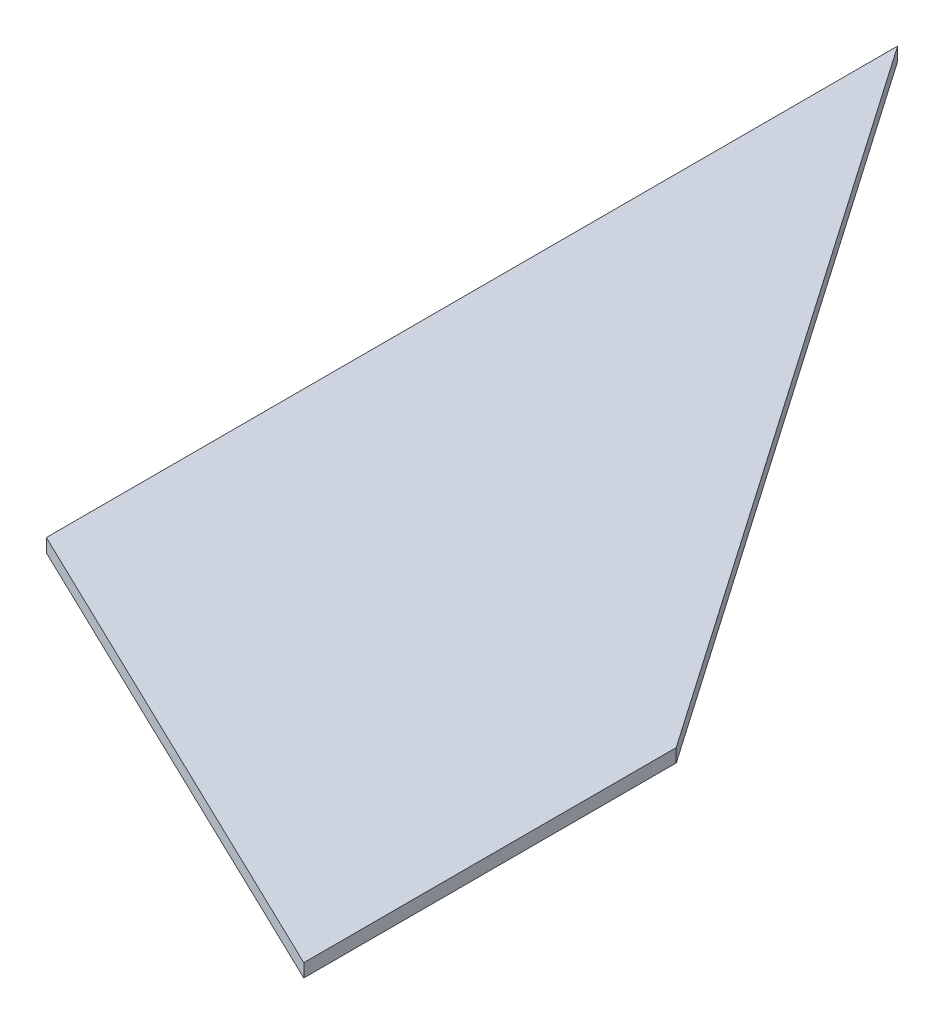
ISO-10303-21;
HEADER;
FILE_DESCRIPTION(('STEP AP214'),'2;1');
FILE_NAME('part.step','',(''),(''),'','','');
FILE_SCHEMA(('AUTOMOTIVE_DESIGN { 1 0 10303 214 1 1 1 1 }'));
ENDSEC;
DATA;
#1=APPLICATION_CONTEXT('core data for automotive mechanical design processes');
#2=APPLICATION_PROTOCOL_DEFINITION('international standard','automotive_design',2000,#1);
#3=PRODUCT_CONTEXT('',#1,'mechanical');
#4=PRODUCT('Part','Part','',(#3));
#5=PRODUCT_RELATED_PRODUCT_CATEGORY('part','',(#4));
#6=PRODUCT_DEFINITION_FORMATION('','',#4);
#7=PRODUCT_DEFINITION_CONTEXT('part definition',#1,'design');
#8=PRODUCT_DEFINITION('design','',#6,#7);
#9=PRODUCT_DEFINITION_SHAPE('','',#8);
#10=(LENGTH_UNIT() NAMED_UNIT(*) SI_UNIT(.MILLI.,.METRE.));
#11=(NAMED_UNIT(*) PLANE_ANGLE_UNIT() SI_UNIT($,.RADIAN.));
#12=(NAMED_UNIT(*) SI_UNIT($,.STERADIAN.) SOLID_ANGLE_UNIT());
#13=UNCERTAINTY_MEASURE_WITH_UNIT(LENGTH_MEASURE(1.E-05),#10,'distance_accuracy_value','');
#14=(GEOMETRIC_REPRESENTATION_CONTEXT(3) GLOBAL_UNCERTAINTY_ASSIGNED_CONTEXT((#13)) GLOBAL_UNIT_ASSIGNED_CONTEXT((#10,
#11,#12)) REPRESENTATION_CONTEXT('',''));
#15=CARTESIAN_POINT('',(0.,0.,0.));
#16=DIRECTION('',(0.,0.,1.));
#17=DIRECTION('',(1.,0.,0.));
#18=AXIS2_PLACEMENT_3D('',#15,#16,#17);
#19=CARTESIAN_POINT('',(118.59918900774,3.175,57.15));
#20=DIRECTION('',(0.434103483654877,0.,-0.900863011494367));
#21=DIRECTION('',(-0.900863011494367,0.,-0.434103483654877));
#22=AXIS2_PLACEMENT_3D('',#19,#20,#21);
#23=PLANE('',#22);
#24=DIRECTION('',(0.900863011494367,0.,0.434103483654877));
#25=VECTOR('',#24,1.);
#26=CARTESIAN_POINT('',(118.59918900774,0.,57.15));
#27=LINE('',#26,#25);
#28=CARTESIAN_POINT('',(0.,0.,0.));
#29=VERTEX_POINT('',#28);
#30=CARTESIAN_POINT('',(118.59918900774,0.,57.15));
#31=VERTEX_POINT('',#30);
#32=EDGE_CURVE('E113',#29,#31,#27,.T.);
#33=ORIENTED_EDGE('',*,*,#32,.T.);
#34=DIRECTION('',(0.,-1.,0.));
#35=VECTOR('',#34,1.);
#36=CARTESIAN_POINT('',(118.59918900774,3.175,57.15));
#37=LINE('',#36,#35);
#38=CARTESIAN_POINT('',(118.59918900774,3.175,57.15));
#39=VERTEX_POINT('',#38);
#40=EDGE_CURVE('E11',#39,#31,#37,.T.);
#41=ORIENTED_EDGE('',*,*,#40,.F.);
#42=DIRECTION('',(0.900863011494367,0.,0.434103483654877));
#43=VECTOR('',#42,1.);
#44=CARTESIAN_POINT('',(118.59918900774,3.175,57.15));
#45=LINE('',#44,#43);
#46=CARTESIAN_POINT('',(0.,3.175,0.));
#47=VERTEX_POINT('',#46);
#48=EDGE_CURVE('E97',#47,#39,#45,.T.);
#49=ORIENTED_EDGE('',*,*,#48,.F.);
#50=DIRECTION('',(0.,-1.,0.));
#51=VECTOR('',#50,1.);
#52=CARTESIAN_POINT('',(0.,3.175,0.));
#53=LINE('',#52,#51);
#54=EDGE_CURVE('E109',#47,#29,#53,.T.);
#55=ORIENTED_EDGE('',*,*,#54,.T.);
#56=EDGE_LOOP('',(#33,#41,#49,#55));
#57=FACE_BOUND('',#56,.T.);
#58=ADVANCED_FACE('F45',(#57),#23,.F.);
#59=CARTESIAN_POINT('',(118.59918900774,3.175,-31.75));
#60=DIRECTION('',(-1.,0.,0.));
#61=DIRECTION('',(0.,0.,1.));
#62=AXIS2_PLACEMENT_3D('',#59,#60,#61);
#63=PLANE('',#62);
#64=DIRECTION('',(0.,0.,-1.));
#65=VECTOR('',#64,1.);
#66=CARTESIAN_POINT('',(118.59918900774,0.,-31.75));
#67=LINE('',#66,#65);
#68=CARTESIAN_POINT('',(118.59918900774,0.,-31.75));
#69=VERTEX_POINT('',#68);
#70=EDGE_CURVE('E102',#31,#69,#67,.T.);
#71=ORIENTED_EDGE('',*,*,#70,.T.);
#72=DIRECTION('',(0.,-1.,0.));
#73=VECTOR('',#72,1.);
#74=CARTESIAN_POINT('',(118.59918900774,3.175,-31.75));
#75=LINE('',#74,#73);
#76=CARTESIAN_POINT('',(118.59918900774,3.175,-31.75));
#77=VERTEX_POINT('',#76);
#78=EDGE_CURVE('E54',#77,#69,#75,.T.);
#79=ORIENTED_EDGE('',*,*,#78,.F.);
#80=DIRECTION('',(0.,0.,-1.));
#81=VECTOR('',#80,1.);
#82=CARTESIAN_POINT('',(118.59918900774,3.175,-31.75));
#83=LINE('',#82,#81);
#84=EDGE_CURVE('E92',#39,#77,#83,.T.);
#85=ORIENTED_EDGE('',*,*,#84,.F.);
#86=ORIENTED_EDGE('',*,*,#40,.T.);
#87=EDGE_LOOP('',(#71,#79,#85,#86));
#88=FACE_BOUND('',#87,.T.);
#89=ADVANCED_FACE('F101',(#88),#63,.F.);
#90=CARTESIAN_POINT('',(0.,3.175,-203.2));
#91=DIRECTION('',(-0.822409807711218,0.,0.568895516048771));
#92=DIRECTION('',(0.568895516048771,0.,0.822409807711218));
#93=AXIS2_PLACEMENT_3D('',#90,#91,#92);
#94=PLANE('',#93);
#95=DIRECTION('',(-0.568895516048771,0.,-0.822409807711218));
#96=VECTOR('',#95,1.);
#97=CARTESIAN_POINT('',(0.,0.,-203.2));
#98=LINE('',#97,#96);
#99=CARTESIAN_POINT('',(0.,0.,-203.2));
#100=VERTEX_POINT('',#99);
#101=EDGE_CURVE('E79',#69,#100,#98,.T.);
#102=ORIENTED_EDGE('',*,*,#101,.T.);
#103=DIRECTION('',(0.,-1.,0.));
#104=VECTOR('',#103,1.);
#105=CARTESIAN_POINT('',(0.,3.175,-203.2));
#106=LINE('',#105,#104);
#107=CARTESIAN_POINT('',(0.,3.175,-203.2));
#108=VERTEX_POINT('',#107);
#109=EDGE_CURVE('E104',#108,#100,#106,.T.);
#110=ORIENTED_EDGE('',*,*,#109,.F.);
#111=DIRECTION('',(-0.568895516048771,0.,-0.822409807711218));
#112=VECTOR('',#111,1.);
#113=CARTESIAN_POINT('',(0.,3.175,-203.2));
#114=LINE('',#113,#112);
#115=EDGE_CURVE('E95',#77,#108,#114,.T.);
#116=ORIENTED_EDGE('',*,*,#115,.F.);
#117=ORIENTED_EDGE('',*,*,#78,.T.);
#118=EDGE_LOOP('',(#102,#110,#116,#117));
#119=FACE_BOUND('',#118,.T.);
#120=ADVANCED_FACE('F105',(#119),#94,.F.);
#121=CARTESIAN_POINT('',(0.,3.175,0.));
#122=DIRECTION('',(1.,0.,0.));
#123=DIRECTION('',(0.,0.,-1.));
#124=AXIS2_PLACEMENT_3D('',#121,#122,#123);
#125=PLANE('',#124);
#126=DIRECTION('',(0.,0.,1.));
#127=VECTOR('',#126,1.);
#128=CARTESIAN_POINT('',(0.,0.,0.));
#129=LINE('',#128,#127);
#130=EDGE_CURVE('E85',#100,#29,#129,.T.);
#131=ORIENTED_EDGE('',*,*,#130,.T.);
#132=ORIENTED_EDGE('',*,*,#54,.F.);
#133=DIRECTION('',(0.,0.,1.));
#134=VECTOR('',#133,1.);
#135=CARTESIAN_POINT('',(0.,3.175,0.));
#136=LINE('',#135,#134);
#137=EDGE_CURVE('E62',#108,#47,#136,.T.);
#138=ORIENTED_EDGE('',*,*,#137,.F.);
#139=ORIENTED_EDGE('',*,*,#109,.T.);
#140=EDGE_LOOP('',(#131,#132,#138,#139));
#141=FACE_BOUND('',#140,.T.);
#142=ADVANCED_FACE('F126',(#141),#125,.F.);
#143=CARTESIAN_POINT('',(0.,3.175,0.));
#144=DIRECTION('',(0.,-1.,0.));
#145=DIRECTION('',(0.,0.,-1.));
#146=AXIS2_PLACEMENT_3D('',#143,#144,#145);
#147=PLANE('',#146);
#148=ORIENTED_EDGE('',*,*,#48,.T.);
#149=ORIENTED_EDGE('',*,*,#84,.T.);
#150=ORIENTED_EDGE('',*,*,#115,.T.);
#151=ORIENTED_EDGE('',*,*,#137,.T.);
#152=EDGE_LOOP('',(#148,#149,#150,#151));
#153=FACE_BOUND('',#152,.T.);
#154=ADVANCED_FACE('F93',(#153),#147,.F.);
#155=CARTESIAN_POINT('',(0.,0.,0.));
#156=DIRECTION('',(0.,-1.,0.));
#157=DIRECTION('',(0.,0.,-1.));
#158=AXIS2_PLACEMENT_3D('',#155,#156,#157);
#159=PLANE('',#158);
#160=ORIENTED_EDGE('',*,*,#32,.F.);
#161=ORIENTED_EDGE('',*,*,#130,.F.);
#162=ORIENTED_EDGE('',*,*,#101,.F.);
#163=ORIENTED_EDGE('',*,*,#70,.F.);
#164=EDGE_LOOP('',(#160,#161,#162,#163));
#165=FACE_BOUND('',#164,.T.);
#166=ADVANCED_FACE('F129',(#165),#159,.T.);
#167=CLOSED_SHELL('',(#58,#89,#120,#142,#154,#166));
#168=MANIFOLD_SOLID_BREP('B2',#167);
#169=ADVANCED_BREP_SHAPE_REPRESENTATION('',(#18,#168),#14);
#170=SHAPE_DEFINITION_REPRESENTATION(#9,#169);
ENDSEC;
END-ISO-10303-21;
